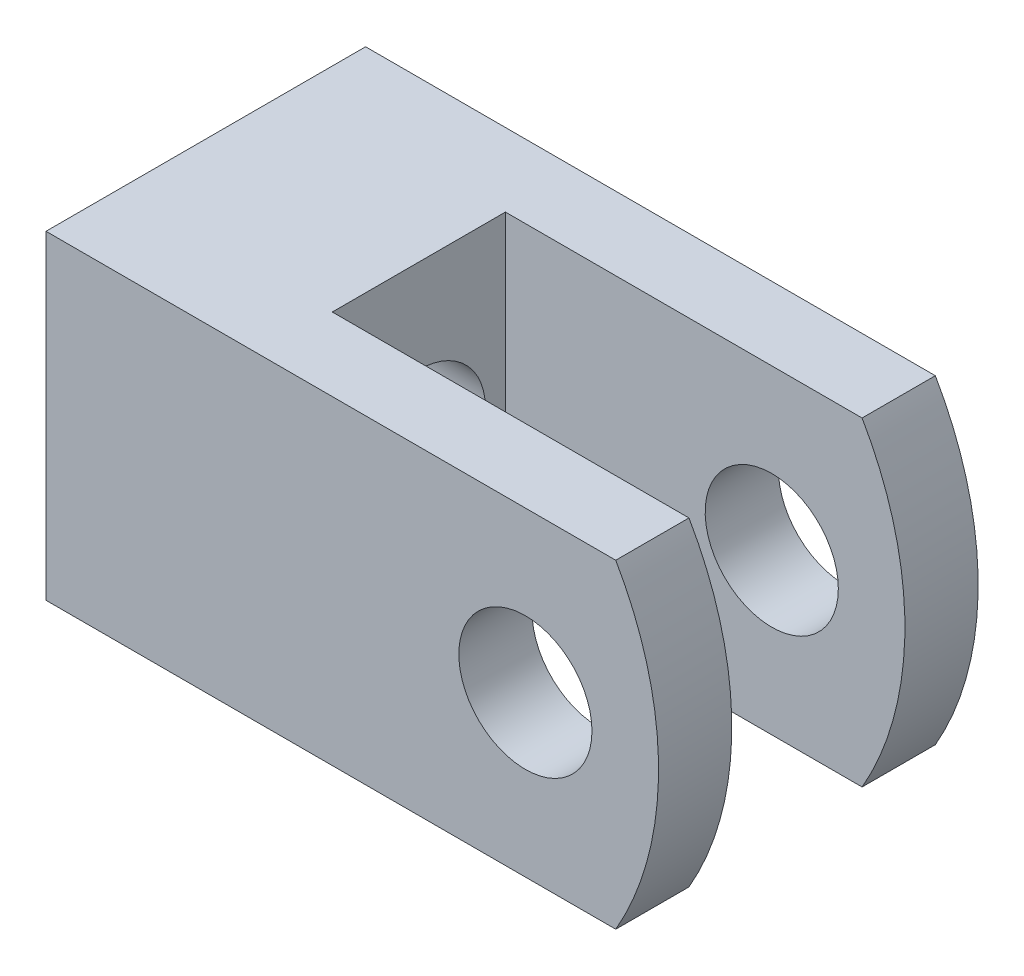
ISO-10303-21;
HEADER;
FILE_DESCRIPTION(('STEP AP214'),'2;1');
FILE_NAME('part.step','',(''),(''),'','','');
FILE_SCHEMA(('AUTOMOTIVE_DESIGN { 1 0 10303 214 1 1 1 1 }'));
ENDSEC;
DATA;
#1=APPLICATION_CONTEXT('core data for automotive mechanical design processes');
#2=APPLICATION_PROTOCOL_DEFINITION('international standard','automotive_design',2000,#1);
#3=PRODUCT_CONTEXT('',#1,'mechanical');
#4=PRODUCT('Part','Part','',(#3));
#5=PRODUCT_RELATED_PRODUCT_CATEGORY('part','',(#4));
#6=PRODUCT_DEFINITION_FORMATION('','',#4);
#7=PRODUCT_DEFINITION_CONTEXT('part definition',#1,'design');
#8=PRODUCT_DEFINITION('design','',#6,#7);
#9=PRODUCT_DEFINITION_SHAPE('','',#8);
#10=(LENGTH_UNIT() NAMED_UNIT(*) SI_UNIT(.MILLI.,.METRE.));
#11=(NAMED_UNIT(*) PLANE_ANGLE_UNIT() SI_UNIT($,.RADIAN.));
#12=(NAMED_UNIT(*) SI_UNIT($,.STERADIAN.) SOLID_ANGLE_UNIT());
#13=UNCERTAINTY_MEASURE_WITH_UNIT(LENGTH_MEASURE(1.E-05),#10,'distance_accuracy_value','');
#14=(GEOMETRIC_REPRESENTATION_CONTEXT(3) GLOBAL_UNCERTAINTY_ASSIGNED_CONTEXT((#13)) GLOBAL_UNIT_ASSIGNED_CONTEXT((#10,
#11,#12)) REPRESENTATION_CONTEXT('',''));
#15=CARTESIAN_POINT('',(0.,0.,0.));
#16=DIRECTION('',(0.,0.,1.));
#17=DIRECTION('',(1.,0.,0.));
#18=AXIS2_PLACEMENT_3D('',#15,#16,#17);
#19=CARTESIAN_POINT('',(-7.00000000000001,0.,6.00000000000001));
#20=DIRECTION('',(0.,0.,-1.));
#21=DIRECTION('',(-1.,0.,0.));
#22=AXIS2_PLACEMENT_3D('',#19,#20,#21);
#23=CYLINDRICAL_SURFACE('',#22,12.);
#24=DIRECTION('',(0.,0.,-1.));
#25=VECTOR('',#24,1.);
#26=CARTESIAN_POINT('',(3.39230484541327,6.,6.00000000000001));
#27=LINE('',#26,#25);
#28=CARTESIAN_POINT('',(3.39230484541327,6.,-3.25));
#29=VERTEX_POINT('',#28);
#30=CARTESIAN_POINT('',(3.39230484541327,6.,-6.00000000000001));
#31=VERTEX_POINT('',#30);
#32=EDGE_CURVE('E159',#29,#31,#27,.T.);
#33=ORIENTED_EDGE('',*,*,#32,.F.);
#34=CARTESIAN_POINT('',(-7.00000000000001,0.,-3.25));
#35=DIRECTION('',(0.,0.,-1.));
#36=DIRECTION('',(0.,1.,0.));
#37=AXIS2_PLACEMENT_3D('',#34,#35,#36);
#38=CIRCLE('',#37,12.);
#39=CARTESIAN_POINT('',(3.39230484541327,-6.00000000000001,-3.25));
#40=VERTEX_POINT('',#39);
#41=EDGE_CURVE('E131',#29,#40,#38,.T.);
#42=ORIENTED_EDGE('',*,*,#41,.T.);
#43=DIRECTION('',(0.,0.,-1.));
#44=VECTOR('',#43,1.);
#45=CARTESIAN_POINT('',(3.39230484541327,-6.00000000000001,6.00000000000001));
#46=LINE('',#45,#44);
#47=CARTESIAN_POINT('',(3.39230484541327,-6.00000000000001,-6.00000000000001));
#48=VERTEX_POINT('',#47);
#49=EDGE_CURVE('E163',#40,#48,#46,.T.);
#50=ORIENTED_EDGE('',*,*,#49,.T.);
#51=CARTESIAN_POINT('',(-7.00000000000001,0.,-6.00000000000001));
#52=DIRECTION('',(0.,0.,1.));
#53=DIRECTION('',(1.,0.,0.));
#54=AXIS2_PLACEMENT_3D('',#51,#52,#53);
#55=CIRCLE('',#54,12.);
#56=EDGE_CURVE('E144',#48,#31,#55,.T.);
#57=ORIENTED_EDGE('',*,*,#56,.T.);
#58=EDGE_LOOP('',(#33,#42,#50,#57));
#59=FACE_BOUND('',#58,.T.);
#60=ADVANCED_FACE('F34',(#59),#23,.T.);
#61=CARTESIAN_POINT('',(-18.,6.,6.00000000000001));
#62=DIRECTION('',(1.,0.,0.));
#63=DIRECTION('',(0.,0.,-1.));
#64=AXIS2_PLACEMENT_3D('',#61,#62,#63);
#65=PLANE('',#64);
#66=CARTESIAN_POINT('',(-18.,0.,0.));
#67=DIRECTION('',(1.,0.,0.));
#68=DIRECTION('',(0.,0.,-1.));
#69=AXIS2_PLACEMENT_3D('',#66,#67,#68);
#70=CIRCLE('',#69,2.7);
#71=CARTESIAN_POINT('',(-18.,0.,-2.7));
#72=VERTEX_POINT('',#71);
#73=EDGE_CURVE('E11',#72,#72,#70,.T.);
#74=ORIENTED_EDGE('',*,*,#73,.T.);
#75=EDGE_LOOP('',(#74));
#76=FACE_BOUND('',#75,.T.);
#77=DIRECTION('',(0.,-1.,0.));
#78=VECTOR('',#77,1.);
#79=CARTESIAN_POINT('',(-18.,6.,-6.00000000000001));
#80=LINE('',#79,#78);
#81=CARTESIAN_POINT('',(-18.,6.,-6.00000000000001));
#82=VERTEX_POINT('',#81);
#83=CARTESIAN_POINT('',(-18.,-6.,-6.00000000000001));
#84=VERTEX_POINT('',#83);
#85=EDGE_CURVE('E138',#82,#84,#80,.T.);
#86=ORIENTED_EDGE('',*,*,#85,.T.);
#87=DIRECTION('',(0.,0.,-1.));
#88=VECTOR('',#87,1.);
#89=CARTESIAN_POINT('',(-18.,-6.,6.00000000000001));
#90=LINE('',#89,#88);
#91=CARTESIAN_POINT('',(-18.,-6.,6.00000000000001));
#92=VERTEX_POINT('',#91);
#93=EDGE_CURVE('E166',#92,#84,#90,.T.);
#94=ORIENTED_EDGE('',*,*,#93,.F.);
#95=DIRECTION('',(0.,-1.,0.));
#96=VECTOR('',#95,1.);
#97=CARTESIAN_POINT('',(-18.,6.,6.00000000000001));
#98=LINE('',#97,#96);
#99=CARTESIAN_POINT('',(-18.,6.,6.00000000000001));
#100=VERTEX_POINT('',#99);
#101=EDGE_CURVE('E149',#100,#92,#98,.T.);
#102=ORIENTED_EDGE('',*,*,#101,.F.);
#103=DIRECTION('',(0.,0.,-1.));
#104=VECTOR('',#103,1.);
#105=CARTESIAN_POINT('',(-18.,6.,6.00000000000001));
#106=LINE('',#105,#104);
#107=EDGE_CURVE('E156',#100,#82,#106,.T.);
#108=ORIENTED_EDGE('',*,*,#107,.T.);
#109=EDGE_LOOP('',(#86,#94,#102,#108));
#110=FACE_BOUND('',#109,.T.);
#111=ADVANCED_FACE('F36',(#76,#110),#65,.F.);
#112=CARTESIAN_POINT('',(-18.,-6.,6.00000000000001));
#113=DIRECTION('',(0.,1.,0.));
#114=DIRECTION('',(-1.,0.,0.));
#115=AXIS2_PLACEMENT_3D('',#112,#113,#114);
#116=PLANE('',#115);
#117=DIRECTION('',(0.,0.,-1.));
#118=VECTOR('',#117,1.);
#119=CARTESIAN_POINT('',(-9.99999999999999,-6.00000000000001,3.25));
#120=LINE('',#119,#118);
#121=CARTESIAN_POINT('',(-9.99999999999999,-6.00000000000001,3.25));
#122=VERTEX_POINT('',#121);
#123=CARTESIAN_POINT('',(-9.99999999999999,-6.00000000000001,-3.25));
#124=VERTEX_POINT('',#123);
#125=EDGE_CURVE('E115',#122,#124,#120,.T.);
#126=ORIENTED_EDGE('',*,*,#125,.F.);
#127=DIRECTION('',(1.,0.,0.));
#128=VECTOR('',#127,1.);
#129=CARTESIAN_POINT('',(-9.99999999999999,-6.00000000000001,3.25));
#130=LINE('',#129,#128);
#131=CARTESIAN_POINT('',(3.39230484541327,-6.00000000000001,3.25));
#132=VERTEX_POINT('',#131);
#133=EDGE_CURVE('E101',#122,#132,#130,.T.);
#134=ORIENTED_EDGE('',*,*,#133,.T.);
#135=CARTESIAN_POINT('',(3.39230484541327,-6.00000000000001,6.00000000000001));
#136=VERTEX_POINT('',#135);
#137=EDGE_CURVE('E164',#136,#132,#46,.T.);
#138=ORIENTED_EDGE('',*,*,#137,.F.);
#139=DIRECTION('',(1.,0.,0.));
#140=VECTOR('',#139,1.);
#141=CARTESIAN_POINT('',(-18.,-6.,6.00000000000001));
#142=LINE('',#141,#140);
#143=EDGE_CURVE('E151',#92,#136,#142,.T.);
#144=ORIENTED_EDGE('',*,*,#143,.F.);
#145=ORIENTED_EDGE('',*,*,#93,.T.);
#146=DIRECTION('',(1.,0.,0.));
#147=VECTOR('',#146,1.);
#148=CARTESIAN_POINT('',(-18.,-6.,-6.00000000000001));
#149=LINE('',#148,#147);
#150=EDGE_CURVE('E141',#84,#48,#149,.T.);
#151=ORIENTED_EDGE('',*,*,#150,.T.);
#152=ORIENTED_EDGE('',*,*,#49,.F.);
#153=DIRECTION('',(1.,0.,0.));
#154=VECTOR('',#153,1.);
#155=CARTESIAN_POINT('',(-9.99999999999999,-6.00000000000001,-3.25));
#156=LINE('',#155,#154);
#157=EDGE_CURVE('E111',#124,#40,#156,.T.);
#158=ORIENTED_EDGE('',*,*,#157,.F.);
#159=EDGE_LOOP('',(#126,#134,#138,#144,#145,#151,#152,#158));
#160=FACE_BOUND('',#159,.T.);
#161=ADVANCED_FACE('F121',(#160),#116,.F.);
#162=ORIENTED_EDGE('',*,*,#137,.T.);
#163=CARTESIAN_POINT('',(-7.00000000000001,0.,3.25));
#164=DIRECTION('',(0.,0.,1.));
#165=DIRECTION('',(0.,-1.,0.));
#166=AXIS2_PLACEMENT_3D('',#163,#164,#165);
#167=CIRCLE('',#166,12.);
#168=CARTESIAN_POINT('',(3.39230484541327,6.,3.25));
#169=VERTEX_POINT('',#168);
#170=EDGE_CURVE('E106',#132,#169,#167,.T.);
#171=ORIENTED_EDGE('',*,*,#170,.T.);
#172=CARTESIAN_POINT('',(3.39230484541327,6.,6.00000000000001));
#173=VERTEX_POINT('',#172);
#174=EDGE_CURVE('E160',#173,#169,#27,.T.);
#175=ORIENTED_EDGE('',*,*,#174,.F.);
#176=CARTESIAN_POINT('',(-7.00000000000001,0.,6.00000000000001));
#177=DIRECTION('',(0.,0.,1.));
#178=DIRECTION('',(1.,0.,0.));
#179=AXIS2_PLACEMENT_3D('',#176,#177,#178);
#180=CIRCLE('',#179,12.);
#181=EDGE_CURVE('E153',#136,#173,#180,.T.);
#182=ORIENTED_EDGE('',*,*,#181,.F.);
#183=EDGE_LOOP('',(#162,#171,#175,#182));
#184=FACE_BOUND('',#183,.T.);
#185=ADVANCED_FACE('F195',(#184),#23,.T.);
#186=CARTESIAN_POINT('',(-18.,6.,6.00000000000001));
#187=DIRECTION('',(0.,-1.,0.));
#188=DIRECTION('',(1.,0.,0.));
#189=AXIS2_PLACEMENT_3D('',#186,#187,#188);
#190=PLANE('',#189);
#191=ORIENTED_EDGE('',*,*,#174,.T.);
#192=DIRECTION('',(1.,0.,0.));
#193=VECTOR('',#192,1.);
#194=CARTESIAN_POINT('',(-9.99999999999999,6.,3.25));
#195=LINE('',#194,#193);
#196=CARTESIAN_POINT('',(-9.99999999999999,6.,3.25));
#197=VERTEX_POINT('',#196);
#198=EDGE_CURVE('E129',#197,#169,#195,.T.);
#199=ORIENTED_EDGE('',*,*,#198,.F.);
#200=DIRECTION('',(0.,0.,1.));
#201=VECTOR('',#200,1.);
#202=CARTESIAN_POINT('',(-9.99999999999999,6.,3.25));
#203=LINE('',#202,#201);
#204=CARTESIAN_POINT('',(-9.99999999999999,6.,-3.25));
#205=VERTEX_POINT('',#204);
#206=EDGE_CURVE('E112',#205,#197,#203,.T.);
#207=ORIENTED_EDGE('',*,*,#206,.F.);
#208=DIRECTION('',(1.,0.,0.));
#209=VECTOR('',#208,1.);
#210=CARTESIAN_POINT('',(-9.99999999999999,6.,-3.25));
#211=LINE('',#210,#209);
#212=EDGE_CURVE('E132',#205,#29,#211,.T.);
#213=ORIENTED_EDGE('',*,*,#212,.T.);
#214=ORIENTED_EDGE('',*,*,#32,.T.);
#215=DIRECTION('',(-1.,0.,0.));
#216=VECTOR('',#215,1.);
#217=CARTESIAN_POINT('',(-18.,6.,-6.00000000000001));
#218=LINE('',#217,#216);
#219=EDGE_CURVE('E147',#31,#82,#218,.T.);
#220=ORIENTED_EDGE('',*,*,#219,.T.);
#221=ORIENTED_EDGE('',*,*,#107,.F.);
#222=DIRECTION('',(-1.,0.,0.));
#223=VECTOR('',#222,1.);
#224=CARTESIAN_POINT('',(-18.,6.,6.00000000000001));
#225=LINE('',#224,#223);
#226=EDGE_CURVE('E58',#173,#100,#225,.T.);
#227=ORIENTED_EDGE('',*,*,#226,.F.);
#228=EDGE_LOOP('',(#191,#199,#207,#213,#214,#220,#221,#227));
#229=FACE_BOUND('',#228,.T.);
#230=ADVANCED_FACE('F203',(#229),#190,.F.);
#231=CARTESIAN_POINT('',(-7.00000000000001,0.,6.00000000000001));
#232=DIRECTION('',(0.,0.,1.));
#233=DIRECTION('',(1.,0.,0.));
#234=AXIS2_PLACEMENT_3D('',#231,#232,#233);
#235=PLANE('',#234);
#236=CARTESIAN_POINT('',(0.,0.,6.00000000000001));
#237=DIRECTION('',(0.,0.,1.));
#238=DIRECTION('',(1.,0.,0.));
#239=AXIS2_PLACEMENT_3D('',#236,#237,#238);
#240=CIRCLE('',#239,2.5);
#241=CARTESIAN_POINT('',(2.5,0.,6.00000000000001));
#242=VERTEX_POINT('',#241);
#243=EDGE_CURVE('E245',#242,#242,#240,.T.);
#244=ORIENTED_EDGE('',*,*,#243,.F.);
#245=EDGE_LOOP('',(#244));
#246=FACE_BOUND('',#245,.T.);
#247=ORIENTED_EDGE('',*,*,#101,.T.);
#248=ORIENTED_EDGE('',*,*,#143,.T.);
#249=ORIENTED_EDGE('',*,*,#181,.T.);
#250=ORIENTED_EDGE('',*,*,#226,.T.);
#251=EDGE_LOOP('',(#247,#248,#249,#250));
#252=FACE_BOUND('',#251,.T.);
#253=ADVANCED_FACE('F209',(#246,#252),#235,.T.);
#254=CARTESIAN_POINT('',(-7.00000000000001,0.,-6.00000000000001));
#255=DIRECTION('',(0.,0.,1.));
#256=DIRECTION('',(1.,0.,0.));
#257=AXIS2_PLACEMENT_3D('',#254,#255,#256);
#258=PLANE('',#257);
#259=CARTESIAN_POINT('',(0.,0.,-6.00000000000001));
#260=DIRECTION('',(0.,0.,1.));
#261=DIRECTION('',(1.,0.,0.));
#262=AXIS2_PLACEMENT_3D('',#259,#260,#261);
#263=CIRCLE('',#262,2.5);
#264=CARTESIAN_POINT('',(2.5,0.,-6.00000000000001));
#265=VERTEX_POINT('',#264);
#266=EDGE_CURVE('E247',#265,#265,#263,.T.);
#267=ORIENTED_EDGE('',*,*,#266,.T.);
#268=EDGE_LOOP('',(#267));
#269=FACE_BOUND('',#268,.T.);
#270=ORIENTED_EDGE('',*,*,#85,.F.);
#271=ORIENTED_EDGE('',*,*,#219,.F.);
#272=ORIENTED_EDGE('',*,*,#56,.F.);
#273=ORIENTED_EDGE('',*,*,#150,.F.);
#274=EDGE_LOOP('',(#270,#271,#272,#273));
#275=FACE_BOUND('',#274,.T.);
#276=ADVANCED_FACE('F219',(#269,#275),#258,.F.);
#277=CARTESIAN_POINT('',(-9.99999999999999,6.,3.25));
#278=DIRECTION('',(0.,0.,1.));
#279=DIRECTION('',(0.,-1.,0.));
#280=AXIS2_PLACEMENT_3D('',#277,#278,#279);
#281=PLANE('',#280);
#282=CARTESIAN_POINT('',(0.,0.,3.25));
#283=DIRECTION('',(0.,0.,1.));
#284=DIRECTION('',(0.,-1.,0.));
#285=AXIS2_PLACEMENT_3D('',#282,#283,#284);
#286=CIRCLE('',#285,2.5);
#287=CARTESIAN_POINT('',(0.,-2.5,3.25));
#288=VERTEX_POINT('',#287);
#289=EDGE_CURVE('E171',#288,#288,#286,.T.);
#290=ORIENTED_EDGE('',*,*,#289,.T.);
#291=EDGE_LOOP('',(#290));
#292=FACE_BOUND('',#291,.T.);
#293=ORIENTED_EDGE('',*,*,#133,.F.);
#294=DIRECTION('',(0.,-1.,0.));
#295=VECTOR('',#294,1.);
#296=CARTESIAN_POINT('',(-9.99999999999999,6.,3.25));
#297=LINE('',#296,#295);
#298=EDGE_CURVE('E105',#197,#122,#297,.T.);
#299=ORIENTED_EDGE('',*,*,#298,.F.);
#300=ORIENTED_EDGE('',*,*,#198,.T.);
#301=ORIENTED_EDGE('',*,*,#170,.F.);
#302=EDGE_LOOP('',(#293,#299,#300,#301));
#303=FACE_BOUND('',#302,.T.);
#304=ADVANCED_FACE('F103',(#292,#303),#281,.F.);
#305=CARTESIAN_POINT('',(-9.99999999999999,6.,-3.25));
#306=DIRECTION('',(0.,0.,-1.));
#307=DIRECTION('',(0.,1.,0.));
#308=AXIS2_PLACEMENT_3D('',#305,#306,#307);
#309=PLANE('',#308);
#310=CARTESIAN_POINT('',(0.,0.,-3.25));
#311=DIRECTION('',(0.,0.,-1.));
#312=DIRECTION('',(0.,1.,0.));
#313=AXIS2_PLACEMENT_3D('',#310,#311,#312);
#314=CIRCLE('',#313,2.5);
#315=CARTESIAN_POINT('',(0.,2.5,-3.25));
#316=VERTEX_POINT('',#315);
#317=EDGE_CURVE('E38',#316,#316,#314,.T.);
#318=ORIENTED_EDGE('',*,*,#317,.T.);
#319=EDGE_LOOP('',(#318));
#320=FACE_BOUND('',#319,.T.);
#321=ORIENTED_EDGE('',*,*,#212,.F.);
#322=DIRECTION('',(0.,1.,0.));
#323=VECTOR('',#322,1.);
#324=CARTESIAN_POINT('',(-9.99999999999999,6.,-3.25));
#325=LINE('',#324,#323);
#326=EDGE_CURVE('E50',#124,#205,#325,.T.);
#327=ORIENTED_EDGE('',*,*,#326,.F.);
#328=ORIENTED_EDGE('',*,*,#157,.T.);
#329=ORIENTED_EDGE('',*,*,#41,.F.);
#330=EDGE_LOOP('',(#321,#327,#328,#329));
#331=FACE_BOUND('',#330,.T.);
#332=ADVANCED_FACE('F222',(#320,#331),#309,.F.);
#333=CARTESIAN_POINT('',(-9.99999999999999,-6.00000000000001,3.25));
#334=DIRECTION('',(1.,0.,0.));
#335=DIRECTION('',(0.,0.,-1.));
#336=AXIS2_PLACEMENT_3D('',#333,#334,#335);
#337=PLANE('',#336);
#338=CARTESIAN_POINT('',(-9.99999999999999,0.,0.));
#339=DIRECTION('',(1.,0.,0.));
#340=DIRECTION('',(0.,0.,-1.));
#341=AXIS2_PLACEMENT_3D('',#338,#339,#340);
#342=CIRCLE('',#341,2.5);
#343=CARTESIAN_POINT('',(-9.99999999999999,0.,-2.5));
#344=VERTEX_POINT('',#343);
#345=EDGE_CURVE('E119',#344,#344,#342,.T.);
#346=ORIENTED_EDGE('',*,*,#345,.F.);
#347=EDGE_LOOP('',(#346));
#348=FACE_BOUND('',#347,.T.);
#349=ORIENTED_EDGE('',*,*,#298,.T.);
#350=ORIENTED_EDGE('',*,*,#125,.T.);
#351=ORIENTED_EDGE('',*,*,#326,.T.);
#352=ORIENTED_EDGE('',*,*,#206,.T.);
#353=EDGE_LOOP('',(#349,#350,#351,#352));
#354=FACE_BOUND('',#353,.T.);
#355=ADVANCED_FACE('F114',(#348,#354),#337,.T.);
#356=CARTESIAN_POINT('',(-6.99999999999999,0.,0.));
#357=DIRECTION('',(-1.,0.,0.));
#358=DIRECTION('',(0.,0.,1.));
#359=AXIS2_PLACEMENT_3D('',#356,#357,#358);
#360=CYLINDRICAL_SURFACE('',#359,2.5);
#361=CARTESIAN_POINT('',(-17.8,0.,0.));
#362=DIRECTION('',(1.,0.,0.));
#363=DIRECTION('',(0.,0.,-1.));
#364=AXIS2_PLACEMENT_3D('',#361,#362,#363);
#365=CIRCLE('',#364,2.5);
#366=CARTESIAN_POINT('',(-17.8,0.,-2.5));
#367=VERTEX_POINT('',#366);
#368=EDGE_CURVE('E43',#367,#367,#365,.F.);
#369=ORIENTED_EDGE('',*,*,#368,.T.);
#370=EDGE_LOOP('',(#369));
#371=FACE_BOUND('',#370,.T.);
#372=ORIENTED_EDGE('',*,*,#345,.T.);
#373=EDGE_LOOP('',(#372));
#374=FACE_BOUND('',#373,.T.);
#375=ADVANCED_FACE('F175',(#371,#374),#360,.F.);
#376=CARTESIAN_POINT('',(-17.8,0.,0.));
#377=DIRECTION('',(-1.,0.,0.));
#378=DIRECTION('',(0.,0.,1.));
#379=AXIS2_PLACEMENT_3D('',#376,#377,#378);
#380=CONICAL_SURFACE('',#379,2.5,0.785398163397452);
#381=ORIENTED_EDGE('',*,*,#73,.F.);
#382=EDGE_LOOP('',(#381));
#383=FACE_BOUND('',#382,.T.);
#384=ORIENTED_EDGE('',*,*,#368,.F.);
#385=EDGE_LOOP('',(#384));
#386=FACE_BOUND('',#385,.T.);
#387=ADVANCED_FACE('F178',(#383,#386),#380,.F.);
#388=CARTESIAN_POINT('',(0.,0.,-6.00000000000001));
#389=DIRECTION('',(0.,0.,1.));
#390=DIRECTION('',(1.,0.,0.));
#391=AXIS2_PLACEMENT_3D('',#388,#389,#390);
#392=CYLINDRICAL_SURFACE('',#391,2.5);
#393=ORIENTED_EDGE('',*,*,#266,.F.);
#394=EDGE_LOOP('',(#393));
#395=FACE_BOUND('',#394,.T.);
#396=ORIENTED_EDGE('',*,*,#317,.F.);
#397=EDGE_LOOP('',(#396));
#398=FACE_BOUND('',#397,.T.);
#399=ADVANCED_FACE('F180',(#395,#398),#392,.F.);
#400=ORIENTED_EDGE('',*,*,#243,.T.);
#401=EDGE_LOOP('',(#400));
#402=FACE_BOUND('',#401,.T.);
#403=ORIENTED_EDGE('',*,*,#289,.F.);
#404=EDGE_LOOP('',(#403));
#405=FACE_BOUND('',#404,.T.);
#406=ADVANCED_FACE('F187',(#402,#405),#392,.F.);
#407=CLOSED_SHELL('',(#60,#111,#161,#185,#230,#253,#276,#304,#332,#355,#375,#387,#399,#406));
#408=MANIFOLD_SOLID_BREP('B2',#407);
#409=ADVANCED_BREP_SHAPE_REPRESENTATION('',(#18,#408),#14);
#410=SHAPE_DEFINITION_REPRESENTATION(#9,#409);
ENDSEC;
END-ISO-10303-21;
